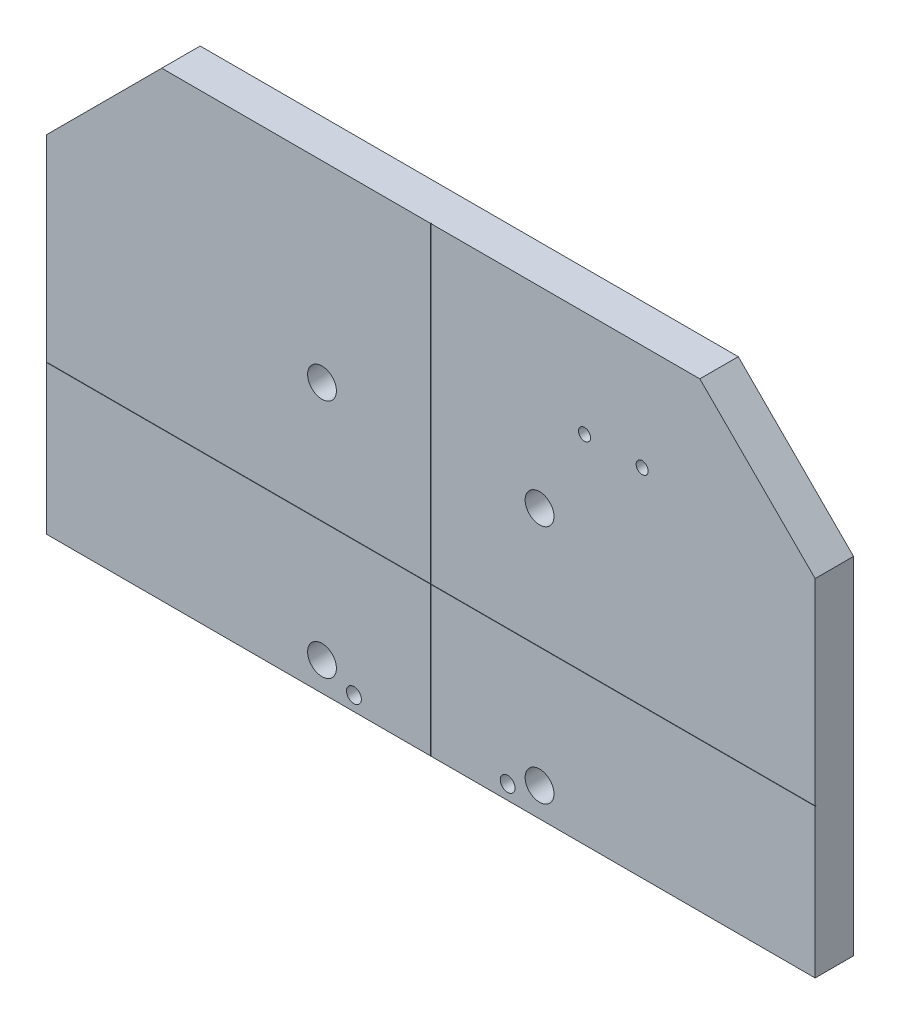
ISO-10303-21;
HEADER;
FILE_DESCRIPTION(('STEP AP214'),'2;1');
FILE_NAME('part.step','',(''),(''),'','','');
FILE_SCHEMA(('AUTOMOTIVE_DESIGN { 1 0 10303 214 1 1 1 1 }'));
ENDSEC;
DATA;
#1=APPLICATION_CONTEXT('core data for automotive mechanical design processes');
#2=APPLICATION_PROTOCOL_DEFINITION('international standard','automotive_design',2000,#1);
#3=PRODUCT_CONTEXT('',#1,'mechanical');
#4=PRODUCT('Part','Part','',(#3));
#5=PRODUCT_RELATED_PRODUCT_CATEGORY('part','',(#4));
#6=PRODUCT_DEFINITION_FORMATION('','',#4);
#7=PRODUCT_DEFINITION_CONTEXT('part definition',#1,'design');
#8=PRODUCT_DEFINITION('design','',#6,#7);
#9=PRODUCT_DEFINITION_SHAPE('','',#8);
#10=(LENGTH_UNIT() NAMED_UNIT(*) SI_UNIT(.MILLI.,.METRE.));
#11=(NAMED_UNIT(*) PLANE_ANGLE_UNIT() SI_UNIT($,.RADIAN.));
#12=(NAMED_UNIT(*) SI_UNIT($,.STERADIAN.) SOLID_ANGLE_UNIT());
#13=UNCERTAINTY_MEASURE_WITH_UNIT(LENGTH_MEASURE(1.E-05),#10,'distance_accuracy_value','');
#14=(GEOMETRIC_REPRESENTATION_CONTEXT(3) GLOBAL_UNCERTAINTY_ASSIGNED_CONTEXT((#13)) GLOBAL_UNIT_ASSIGNED_CONTEXT((#10,
#11,#12)) REPRESENTATION_CONTEXT('',''));
#15=CARTESIAN_POINT('',(0.,0.,0.));
#16=DIRECTION('',(0.,0.,1.));
#17=DIRECTION('',(1.,0.,0.));
#18=AXIS2_PLACEMENT_3D('',#15,#16,#17);
#19=CARTESIAN_POINT('',(0.,0.,25.4));
#20=DIRECTION('',(0.,0.,-1.));
#21=DIRECTION('',(-1.,0.,0.));
#22=AXIS2_PLACEMENT_3D('',#19,#20,#21);
#23=PLANE('',#22);
#24=CARTESIAN_POINT('',(44.6438421052629,-188.745394736842,25.4));
#25=DIRECTION('',(0.,0.,-1.));
#26=DIRECTION('',(-1.,0.,0.));
#27=AXIS2_PLACEMENT_3D('',#24,#25,#26);
#28=CIRCLE('',#27,9.525);
#29=CARTESIAN_POINT('',(35.1188421052629,-188.745394736842,25.4));
#30=VERTEX_POINT('',#29);
#31=EDGE_CURVE('E405',#30,#30,#28,.T.);
#32=ORIENTED_EDGE('',*,*,#31,.T.);
#33=EDGE_LOOP('',(#32));
#34=FACE_BOUND('',#33,.T.);
#35=CARTESIAN_POINT('',(23.561842105263,-198.270394736842,25.4));
#36=DIRECTION('',(0.,0.,-1.));
#37=DIRECTION('',(-1.,0.,0.));
#38=AXIS2_PLACEMENT_3D('',#35,#36,#37);
#39=CIRCLE('',#38,4.90219999999999);
#40=CARTESIAN_POINT('',(18.659642105263,-198.270394736842,25.4));
#41=VERTEX_POINT('',#40);
#42=EDGE_CURVE('E302',#41,#41,#39,.F.);
#43=ORIENTED_EDGE('',*,*,#42,.F.);
#44=EDGE_LOOP('',(#43));
#45=FACE_BOUND('',#44,.T.);
#46=DIRECTION('',(0.,1.,0.));
#47=VECTOR('',#46,1.);
#48=CARTESIAN_POINT('',(226.761842105263,-207.795394736842,25.4));
#49=LINE('',#48,#47);
#50=CARTESIAN_POINT('',(226.761842105263,-207.795394736842,25.4));
#51=VERTEX_POINT('',#50);
#52=CARTESIAN_POINT('',(226.761842105263,-109.497394736842,25.4));
#53=VERTEX_POINT('',#52);
#54=EDGE_CURVE('E159',#51,#53,#49,.T.);
#55=ORIENTED_EDGE('',*,*,#54,.T.);
#56=DIRECTION('',(1.,0.,0.));
#57=VECTOR('',#56,1.);
#58=CARTESIAN_POINT('',(-281.238157894737,-109.497394736842,25.4));
#59=LINE('',#58,#57);
#60=CARTESIAN_POINT('',(-27.1111578947371,-109.497394736842,25.4));
#61=VERTEX_POINT('',#60);
#62=EDGE_CURVE('E134',#61,#53,#59,.T.);
#63=ORIENTED_EDGE('',*,*,#62,.F.);
#64=DIRECTION('',(0.,1.,0.));
#65=VECTOR('',#64,1.);
#66=CARTESIAN_POINT('',(-27.1111578947371,-207.795394736842,25.4));
#67=LINE('',#66,#65);
#68=CARTESIAN_POINT('',(-27.1111578947371,-207.795394736842,25.4));
#69=VERTEX_POINT('',#68);
#70=EDGE_CURVE('E173',#69,#61,#67,.T.);
#71=ORIENTED_EDGE('',*,*,#70,.F.);
#72=DIRECTION('',(1.,0.,0.));
#73=VECTOR('',#72,1.);
#74=CARTESIAN_POINT('',(-281.238157894737,-207.795394736842,25.4));
#75=LINE('',#74,#73);
#76=EDGE_CURVE('E150',#69,#51,#75,.T.);
#77=ORIENTED_EDGE('',*,*,#76,.T.);
#78=EDGE_LOOP('',(#55,#63,#71,#77));
#79=FACE_BOUND('',#78,.T.);
#80=ADVANCED_FACE('F34',(#34,#45,#79),#23,.F.);
#81=CARTESIAN_POINT('',(-99.1201578947371,-188.745394736842,25.4));
#82=DIRECTION('',(0.,0.,-1.));
#83=DIRECTION('',(-1.,0.,0.));
#84=AXIS2_PLACEMENT_3D('',#81,#82,#83);
#85=CIRCLE('',#84,9.525);
#86=CARTESIAN_POINT('',(-108.645157894737,-188.745394736842,25.4));
#87=VERTEX_POINT('',#86);
#88=EDGE_CURVE('E296',#87,#87,#85,.T.);
#89=ORIENTED_EDGE('',*,*,#88,.T.);
#90=EDGE_LOOP('',(#89));
#91=FACE_BOUND('',#90,.T.);
#92=CARTESIAN_POINT('',(-78.0381578947371,-198.270394736842,25.4));
#93=DIRECTION('',(0.,0.,-1.));
#94=DIRECTION('',(-1.,0.,0.));
#95=AXIS2_PLACEMENT_3D('',#92,#93,#94);
#96=CIRCLE('',#95,4.9022);
#97=CARTESIAN_POINT('',(-82.940357894737,-198.270394736842,25.4));
#98=VERTEX_POINT('',#97);
#99=EDGE_CURVE('E314',#98,#98,#96,.F.);
#100=ORIENTED_EDGE('',*,*,#99,.F.);
#101=EDGE_LOOP('',(#100));
#102=FACE_BOUND('',#101,.T.);
#103=DIRECTION('',(0.,1.,0.));
#104=VECTOR('',#103,1.);
#105=CARTESIAN_POINT('',(-27.3651578947371,-207.795394736842,25.4));
#106=LINE('',#105,#104);
#107=CARTESIAN_POINT('',(-27.3651578947371,-207.795394736842,25.4));
#108=VERTEX_POINT('',#107);
#109=CARTESIAN_POINT('',(-27.3651578947371,-109.497394736842,25.4));
#110=VERTEX_POINT('',#109);
#111=EDGE_CURVE('E245',#108,#110,#106,.T.);
#112=ORIENTED_EDGE('',*,*,#111,.T.);
#113=CARTESIAN_POINT('',(-281.238157894737,-109.497394736842,25.4));
#114=VERTEX_POINT('',#113);
#115=EDGE_CURVE('E239',#114,#110,#59,.T.);
#116=ORIENTED_EDGE('',*,*,#115,.F.);
#117=DIRECTION('',(0.,-1.,0.));
#118=VECTOR('',#117,1.);
#119=CARTESIAN_POINT('',(-281.238157894737,20.8046052631579,25.4));
#120=LINE('',#119,#118);
#121=CARTESIAN_POINT('',(-281.238157894737,-207.795394736842,25.4));
#122=VERTEX_POINT('',#121);
#123=EDGE_CURVE('E143',#114,#122,#120,.T.);
#124=ORIENTED_EDGE('',*,*,#123,.T.);
#125=EDGE_CURVE('E152',#122,#108,#75,.T.);
#126=ORIENTED_EDGE('',*,*,#125,.T.);
#127=EDGE_LOOP('',(#112,#116,#124,#126));
#128=FACE_BOUND('',#127,.T.);
#129=ADVANCED_FACE('F334',(#91,#102,#128),#23,.F.);
#130=CARTESIAN_POINT('',(-27.1111578947371,-207.795394736842,25.4));
#131=CARTESIAN_POINT('',(-27.2381578947371,-207.795394736842,23.876));
#132=CARTESIAN_POINT('',(-27.3651578947371,-207.795394736842,25.4));
#133=B_SPLINE_CURVE_WITH_KNOTS('',2,(#130,#131,#132),.UNSPECIFIED.,.F.,.F.,(3,3),(0.,1.),.UNSPECIFIED.);
#134=DIRECTION('',(0.,1.,0.));
#135=VECTOR('',#134,1.);
#136=SURFACE_OF_LINEAR_EXTRUSION('',#133,#135);
#137=CARTESIAN_POINT('',(-27.3651578947371,-109.243394736842,25.4));
#138=VERTEX_POINT('',#137);
#139=CARTESIAN_POINT('',(-27.3651578947371,97.0046052631579,25.4));
#140=VERTEX_POINT('',#139);
#141=EDGE_CURVE('E59',#138,#140,#106,.T.);
#142=ORIENTED_EDGE('',*,*,#141,.F.);
#143=CARTESIAN_POINT('',(-27.3651578947371,-109.243394736842,25.4));
#144=CARTESIAN_POINT('',(-27.3623311640228,-109.246221467556,25.3661208062501));
#145=CARTESIAN_POINT('',(-27.3594179970927,-109.249134634487,25.3322553017689));
#146=CARTESIAN_POINT('',(-27.3533494764242,-109.255203155155,25.2644391079944));
#147=CARTESIAN_POINT('',(-27.350193257297,-109.258359374282,25.2304885740804));
#148=CARTESIAN_POINT('',(-27.3435839773658,-109.264968654213,25.1625857556148));
#149=CARTESIAN_POINT('',(-27.3401304204415,-109.268422211138,25.1286335664471));
#150=CARTESIAN_POINT('',(-27.3326585947945,-109.275894036785,25.0592175809432));
#151=CARTESIAN_POINT('',(-27.3286213985585,-109.279931233021,25.0237578444052));
#152=CARTESIAN_POINT('',(-27.3199341817907,-109.288618449789,24.9530267081136));
#153=CARTESIAN_POINT('',(-27.3152849030863,-109.293267728493,24.9177551333144));
#154=CARTESIAN_POINT('',(-27.3075359401627,-109.301016691416,24.8650949550325));
#155=CARTESIAN_POINT('',(-27.3048254878472,-109.303727143732,24.8475923521645));
#156=CARTESIAN_POINT('',(-27.2990393935693,-109.30951323801,24.812709323625));
#157=CARTESIAN_POINT('',(-27.295963843825,-109.312588787754,24.7953288682707));
#158=CARTESIAN_POINT('',(-27.2901387232055,-109.318413908374,24.7653705910582));
#159=CARTESIAN_POINT('',(-27.2875192502964,-109.321033381283,24.752742311698));
#160=CARTESIAN_POINT('',(-27.2818318634975,-109.326720768082,24.7277200470654));
#161=CARTESIAN_POINT('',(-27.2787653275465,-109.329787304033,24.7153254694827));
#162=CARTESIAN_POINT('',(-27.2739650593901,-109.334587572189,24.698494182416));
#163=CARTESIAN_POINT('',(-27.2725755638676,-109.335977067712,24.6938634939294));
#164=CARTESIAN_POINT('',(-27.2696327888575,-109.338919842722,24.684699414834));
#165=CARTESIAN_POINT('',(-27.2680792846255,-109.340473346954,24.680166168257));
#166=CARTESIAN_POINT('',(-27.2647181077493,-109.34383452383,24.6711921906048));
#167=CARTESIAN_POINT('',(-27.2629068523104,-109.345645779269,24.66675400124));
#168=CARTESIAN_POINT('',(-27.2589372930596,-109.34961533852,24.6582105165422));
#169=CARTESIAN_POINT('',(-27.2567791829199,-109.351773448659,24.654105037348));
#170=CARTESIAN_POINT('',(-27.251831785716,-109.356720845863,24.6465322025202));
#171=CARTESIAN_POINT('',(-27.2490398058636,-109.359512825716,24.6430676872145));
#172=CARTESIAN_POINT('',(-27.2440781112852,-109.364474520294,24.6395319813065));
#173=CARTESIAN_POINT('',(-27.2422447869758,-109.366307844604,24.6386305444928));
#174=CARTESIAN_POINT('',(-27.2396336011086,-109.368919030471,24.6380743633754));
#175=CARTESIAN_POINT('',(-27.2388971149605,-109.369655516619,24.6379941919963));
#176=CARTESIAN_POINT('',(-27.2381578947371,-109.370394736842,24.638));
#177=B_SPLINE_CURVE_WITH_KNOTS('',3,(#143,#144,#145,#146,#147,#148,#149,#150,#151,#152,#153,
#154,#155,#156,#157,#158,#159,#160,#161,#162,#163,#164,#165,#166,#167,#168,#169,#170,#171,#172,
#173,#174,#175,#176),.UNSPECIFIED.,.F.,.F.,(4,2,2,2,2,2,2,2,2,2,2,2,2,2,2,2,4),(0.,
0.102343514307504,0.205069959695053,0.307971259356194,0.415715340605922,0.523330020869911,
0.577078060717716,0.630812553394177,0.670286743818626,0.709641742894189,0.724727876500865,
0.739834958058471,0.755177403743357,0.770511312277877,0.785911622999607,0.793981438851478,
0.797108063588324),.UNSPECIFIED.);
#178=CARTESIAN_POINT('',(-27.2381578947371,-109.370394736842,24.638));
#179=VERTEX_POINT('',#178);
#180=EDGE_CURVE('E11',#138,#179,#177,.T.);
#181=ORIENTED_EDGE('',*,*,#180,.T.);
#182=CARTESIAN_POINT('',(-27.1111578947371,-109.243394736842,25.4));
#183=CARTESIAN_POINT('',(-27.1147586622942,-109.246995504399,25.356924352958));
#184=CARTESIAN_POINT('',(-27.1184894258524,-109.250726267957,25.3138675667452));
#185=CARTESIAN_POINT('',(-27.1263514287,-109.258588270805,25.2278169636741));
#186=CARTESIAN_POINT('',(-27.1304827652935,-109.262719607399,25.1848231647039));
#187=CARTESIAN_POINT('',(-27.1378363759387,-109.270073218044,25.1130764024399));
#188=CARTESIAN_POINT('',(-27.1409103571466,-109.273147199252,25.0842934057058));
#189=CARTESIAN_POINT('',(-27.1473831154631,-109.279619957568,25.0268024596024));
#190=CARTESIAN_POINT('',(-27.1507818733682,-109.283018715473,24.9980945058989));
#191=CARTESIAN_POINT('',(-27.1592630339229,-109.291499876028,24.930915655898));
#192=CARTESIAN_POINT('',(-27.164522156498,-109.296758998603,24.8924874311045));
#193=CARTESIAN_POINT('',(-27.1745268675176,-109.306763709623,24.8285156796447));
#194=CARTESIAN_POINT('',(-27.1788813795354,-109.31111822164,24.8028539448921));
#195=CARTESIAN_POINT('',(-27.1871894401185,-109.319426282223,24.7601905899864));
#196=CARTESIAN_POINT('',(-27.1908186518875,-109.323055493992,24.7430675264785));
#197=CARTESIAN_POINT('',(-27.1977748935544,-109.330011735659,24.7146682490488));
#198=CARTESIAN_POINT('',(-27.2008309585286,-109.333067800634,24.703264436336));
#199=CARTESIAN_POINT('',(-27.2067151101411,-109.338951952246,24.6844268998598));
#200=CARTESIAN_POINT('',(-27.2093195041672,-109.341556346272,24.6768596170707));
#201=CARTESIAN_POINT('',(-27.2138733898308,-109.346110231936,24.6657506417784));
#202=CARTESIAN_POINT('',(-27.215550180326,-109.347787022431,24.6619975045873));
#203=CARTESIAN_POINT('',(-27.2192041243174,-109.351440966422,24.6548061916142));
#204=CARTESIAN_POINT('',(-27.2211817483506,-109.353418590456,24.6513685230057));
#205=CARTESIAN_POINT('',(-27.2259267056595,-109.358163547765,24.6447820481746));
#206=CARTESIAN_POINT('',(-27.228753286126,-109.360990128231,24.6416966350844));
#207=CARTESIAN_POINT('',(-27.2338707468323,-109.366107588937,24.638693580646));
#208=CARTESIAN_POINT('',(-27.2359496698804,-109.368186511985,24.6380140542789));
#209=CARTESIAN_POINT('',(-27.2381578947371,-109.370394736842,24.638));
#210=B_SPLINE_CURVE_WITH_KNOTS('',3,(#182,#183,#184,#185,#186,#187,#188,#189,#190,#191,#192,
#193,#194,#195,#196,#197,#198,#199,#200,#201,#202,#203,#204,#205,#206,#207,#208,#209),
.UNSPECIFIED.,.F.,.F.,(4,2,2,2,2,2,2,2,2,2,2,2,2,4),(0.,0.130130838363292,0.260293366673186,
0.347618440608603,0.434938354340637,0.552330718668359,0.631470489546054,0.685063011786181,
0.721611553206466,0.746815189795231,0.760100411875049,0.773406631325164,0.788045246346206,
0.797054853059102),.UNSPECIFIED.);
#211=CARTESIAN_POINT('',(-27.1111578947371,-109.243394736842,25.4));
#212=VERTEX_POINT('',#211);
#213=EDGE_CURVE('E199',#179,#212,#210,.F.);
#214=ORIENTED_EDGE('',*,*,#213,.T.);
#215=CARTESIAN_POINT('',(-27.1111578947372,97.0046052631579,25.4));
#216=VERTEX_POINT('',#215);
#217=EDGE_CURVE('E244',#212,#216,#67,.T.);
#218=ORIENTED_EDGE('',*,*,#217,.T.);
#219=CARTESIAN_POINT('',(-27.1111578947372,97.0046052631579,25.4));
#220=CARTESIAN_POINT('',(-27.2381578947372,97.0046052631579,23.876));
#221=CARTESIAN_POINT('',(-27.3651578947372,97.0046052631579,25.4));
#222=B_SPLINE_CURVE_WITH_KNOTS('',2,(#219,#220,#221),.UNSPECIFIED.,.F.,.F.,(3,3),(0.,1.),.UNSPECIFIED.);
#223=EDGE_CURVE('E231',#216,#140,#222,.T.);
#224=ORIENTED_EDGE('',*,*,#223,.T.);
#225=EDGE_LOOP('',(#142,#181,#214,#218,#224));
#226=FACE_BOUND('',#225,.T.);
#227=ADVANCED_FACE('F221',(#226),#136,.F.);
#228=CARTESIAN_POINT('',(44.6438421052629,-29.9953947368421,25.4));
#229=DIRECTION('',(0.,0.,-1.));
#230=DIRECTION('',(-1.,0.,0.));
#231=AXIS2_PLACEMENT_3D('',#228,#229,#230);
#232=CIRCLE('',#231,9.525);
#233=CARTESIAN_POINT('',(35.1188421052629,-29.9953947368421,25.4));
#234=VERTEX_POINT('',#233);
#235=EDGE_CURVE('E361',#234,#234,#232,.T.);
#236=ORIENTED_EDGE('',*,*,#235,.T.);
#237=EDGE_LOOP('',(#236));
#238=FACE_BOUND('',#237,.T.);
#239=CARTESIAN_POINT('',(112.461842105263,27.1546052631579,25.4));
#240=DIRECTION('',(0.,0.,-1.));
#241=DIRECTION('',(-1.,0.,0.));
#242=AXIS2_PLACEMENT_3D('',#239,#240,#241);
#243=CIRCLE('',#242,3.97509999999999);
#244=CARTESIAN_POINT('',(108.486742105263,27.1546052631579,25.4));
#245=VERTEX_POINT('',#244);
#246=EDGE_CURVE('E299',#245,#245,#243,.F.);
#247=ORIENTED_EDGE('',*,*,#246,.F.);
#248=EDGE_LOOP('',(#247));
#249=FACE_BOUND('',#248,.T.);
#250=CARTESIAN_POINT('',(74.3618421052629,27.1546052631579,25.4));
#251=DIRECTION('',(0.,0.,-1.));
#252=DIRECTION('',(-1.,0.,0.));
#253=AXIS2_PLACEMENT_3D('',#250,#251,#252);
#254=CIRCLE('',#253,3.97510000000001);
#255=CARTESIAN_POINT('',(70.3867421052629,27.1546052631579,25.4));
#256=VERTEX_POINT('',#255);
#257=EDGE_CURVE('E295',#256,#256,#254,.F.);
#258=ORIENTED_EDGE('',*,*,#257,.F.);
#259=EDGE_LOOP('',(#258));
#260=FACE_BOUND('',#259,.T.);
#261=ORIENTED_EDGE('',*,*,#217,.F.);
#262=DIRECTION('',(1.,0.,0.));
#263=VECTOR('',#262,1.);
#264=CARTESIAN_POINT('',(-281.238157894737,-109.243394736842,25.4));
#265=LINE('',#264,#263);
#266=CARTESIAN_POINT('',(226.761842105263,-109.243394736842,25.4));
#267=VERTEX_POINT('',#266);
#268=EDGE_CURVE('E51',#212,#267,#265,.T.);
#269=ORIENTED_EDGE('',*,*,#268,.T.);
#270=CARTESIAN_POINT('',(226.761842105263,20.8046052631578,25.4));
#271=VERTEX_POINT('',#270);
#272=EDGE_CURVE('E158',#267,#271,#49,.T.);
#273=ORIENTED_EDGE('',*,*,#272,.T.);
#274=DIRECTION('',(-0.707106781186548,0.707106781186547,0.));
#275=VECTOR('',#274,1.);
#276=CARTESIAN_POINT('',(226.761842105263,20.8046052631578,25.4));
#277=LINE('',#276,#275);
#278=CARTESIAN_POINT('',(150.561842105263,97.0046052631579,25.4));
#279=VERTEX_POINT('',#278);
#280=EDGE_CURVE('E162',#271,#279,#277,.T.);
#281=ORIENTED_EDGE('',*,*,#280,.T.);
#282=DIRECTION('',(-1.,0.,0.));
#283=VECTOR('',#282,1.);
#284=CARTESIAN_POINT('',(150.561842105263,97.0046052631579,25.4));
#285=LINE('',#284,#283);
#286=EDGE_CURVE('E165',#279,#216,#285,.T.);
#287=ORIENTED_EDGE('',*,*,#286,.T.);
#288=EDGE_LOOP('',(#261,#269,#273,#281,#287));
#289=FACE_BOUND('',#288,.T.);
#290=ADVANCED_FACE('F257',(#238,#249,#260,#289),#23,.F.);
#291=CARTESIAN_POINT('',(-205.038157894737,97.0046052631579,25.4));
#292=DIRECTION('',(0.707106781186548,-0.707106781186547,0.));
#293=DIRECTION('',(0.707106781186547,0.707106781186548,0.));
#294=AXIS2_PLACEMENT_3D('',#291,#292,#293);
#295=PLANE('',#294);
#296=DIRECTION('',(-0.707106781186547,-0.707106781186548,0.));
#297=VECTOR('',#296,1.);
#298=CARTESIAN_POINT('',(-205.038157894737,97.0046052631579,0.));
#299=LINE('',#298,#297);
#300=CARTESIAN_POINT('',(-205.038157894737,97.0046052631579,0.));
#301=VERTEX_POINT('',#300);
#302=CARTESIAN_POINT('',(-281.238157894737,20.8046052631579,0.));
#303=VERTEX_POINT('',#302);
#304=EDGE_CURVE('E169',#301,#303,#299,.T.);
#305=ORIENTED_EDGE('',*,*,#304,.T.);
#306=DIRECTION('',(0.,0.,-1.));
#307=VECTOR('',#306,1.);
#308=CARTESIAN_POINT('',(-281.238157894737,20.8046052631579,25.4));
#309=LINE('',#308,#307);
#310=CARTESIAN_POINT('',(-281.238157894737,20.8046052631579,25.4));
#311=VERTEX_POINT('',#310);
#312=EDGE_CURVE('E197',#311,#303,#309,.T.);
#313=ORIENTED_EDGE('',*,*,#312,.F.);
#314=DIRECTION('',(-0.707106781186547,-0.707106781186548,0.));
#315=VECTOR('',#314,1.);
#316=CARTESIAN_POINT('',(-205.038157894737,97.0046052631579,25.4));
#317=LINE('',#316,#315);
#318=CARTESIAN_POINT('',(-205.038157894737,97.0046052631579,25.4));
#319=VERTEX_POINT('',#318);
#320=EDGE_CURVE('E148',#319,#311,#317,.T.);
#321=ORIENTED_EDGE('',*,*,#320,.F.);
#322=DIRECTION('',(0.,0.,-1.));
#323=VECTOR('',#322,1.);
#324=CARTESIAN_POINT('',(-205.038157894737,97.0046052631579,25.4));
#325=LINE('',#324,#323);
#326=EDGE_CURVE('E168',#319,#301,#325,.T.);
#327=ORIENTED_EDGE('',*,*,#326,.T.);
#328=EDGE_LOOP('',(#305,#313,#321,#327));
#329=FACE_BOUND('',#328,.T.);
#330=ADVANCED_FACE('F36',(#329),#295,.F.);
#331=CARTESIAN_POINT('',(-281.238157894737,20.8046052631579,25.4));
#332=DIRECTION('',(1.,0.,0.));
#333=DIRECTION('',(0.,1.,0.));
#334=AXIS2_PLACEMENT_3D('',#331,#332,#333);
#335=PLANE('',#334);
#336=ORIENTED_EDGE('',*,*,#123,.F.);
#337=CARTESIAN_POINT('',(-281.238157894737,-109.497394736842,25.4));
#338=CARTESIAN_POINT('',(-281.238157894737,-109.370394736842,23.876));
#339=CARTESIAN_POINT('',(-281.238157894737,-109.243394736842,25.4));
#340=B_SPLINE_CURVE_WITH_KNOTS('',2,(#337,#338,#339),.UNSPECIFIED.,.F.,.F.,(3,3),(0.,1.),.UNSPECIFIED.);
#341=CARTESIAN_POINT('',(-281.238157894737,-109.243394736842,25.4));
#342=VERTEX_POINT('',#341);
#343=EDGE_CURVE('E131',#114,#342,#340,.T.);
#344=ORIENTED_EDGE('',*,*,#343,.T.);
#345=EDGE_CURVE('E140',#311,#342,#120,.T.);
#346=ORIENTED_EDGE('',*,*,#345,.F.);
#347=ORIENTED_EDGE('',*,*,#312,.T.);
#348=DIRECTION('',(0.,-1.,0.));
#349=VECTOR('',#348,1.);
#350=CARTESIAN_POINT('',(-281.238157894737,20.8046052631579,0.));
#351=LINE('',#350,#349);
#352=CARTESIAN_POINT('',(-281.238157894737,-207.795394736842,0.));
#353=VERTEX_POINT('',#352);
#354=EDGE_CURVE('E172',#303,#353,#351,.T.);
#355=ORIENTED_EDGE('',*,*,#354,.T.);
#356=DIRECTION('',(0.,0.,-1.));
#357=VECTOR('',#356,1.);
#358=CARTESIAN_POINT('',(-281.238157894737,-207.795394736842,25.4));
#359=LINE('',#358,#357);
#360=EDGE_CURVE('E194',#122,#353,#359,.T.);
#361=ORIENTED_EDGE('',*,*,#360,.F.);
#362=EDGE_LOOP('',(#336,#344,#346,#347,#355,#361));
#363=FACE_BOUND('',#362,.T.);
#364=ADVANCED_FACE('F138',(#363),#335,.F.);
#365=CARTESIAN_POINT('',(-281.238157894737,-207.795394736842,25.4));
#366=DIRECTION('',(0.,1.,0.));
#367=DIRECTION('',(0.,0.,1.));
#368=AXIS2_PLACEMENT_3D('',#365,#366,#367);
#369=PLANE('',#368);
#370=ORIENTED_EDGE('',*,*,#76,.F.);
#371=EDGE_CURVE('E225',#69,#108,#133,.T.);
#372=ORIENTED_EDGE('',*,*,#371,.T.);
#373=ORIENTED_EDGE('',*,*,#125,.F.);
#374=ORIENTED_EDGE('',*,*,#360,.T.);
#375=DIRECTION('',(1.,0.,0.));
#376=VECTOR('',#375,1.);
#377=CARTESIAN_POINT('',(-281.238157894737,-207.795394736842,0.));
#378=LINE('',#377,#376);
#379=CARTESIAN_POINT('',(226.761842105263,-207.795394736842,0.));
#380=VERTEX_POINT('',#379);
#381=EDGE_CURVE('E175',#353,#380,#378,.T.);
#382=ORIENTED_EDGE('',*,*,#381,.T.);
#383=DIRECTION('',(0.,0.,-1.));
#384=VECTOR('',#383,1.);
#385=CARTESIAN_POINT('',(226.761842105263,-207.795394736842,25.4));
#386=LINE('',#385,#384);
#387=EDGE_CURVE('E191',#51,#380,#386,.T.);
#388=ORIENTED_EDGE('',*,*,#387,.F.);
#389=EDGE_LOOP('',(#370,#372,#373,#374,#382,#388));
#390=FACE_BOUND('',#389,.T.);
#391=ADVANCED_FACE('F274',(#390),#369,.F.);
#392=CARTESIAN_POINT('',(226.761842105263,-207.795394736842,25.4));
#393=DIRECTION('',(-1.,0.,0.));
#394=DIRECTION('',(0.,0.,1.));
#395=AXIS2_PLACEMENT_3D('',#392,#393,#394);
#396=PLANE('',#395);
#397=ORIENTED_EDGE('',*,*,#272,.F.);
#398=CARTESIAN_POINT('',(226.761842105263,-109.497394736842,25.4));
#399=CARTESIAN_POINT('',(226.761842105263,-109.370394736842,23.876));
#400=CARTESIAN_POINT('',(226.761842105263,-109.243394736842,25.4));
#401=B_SPLINE_CURVE_WITH_KNOTS('',2,(#398,#399,#400),.UNSPECIFIED.,.F.,.F.,(3,3),(0.,1.),.UNSPECIFIED.);
#402=EDGE_CURVE('E144',#53,#267,#401,.T.);
#403=ORIENTED_EDGE('',*,*,#402,.F.);
#404=ORIENTED_EDGE('',*,*,#54,.F.);
#405=ORIENTED_EDGE('',*,*,#387,.T.);
#406=DIRECTION('',(0.,1.,0.));
#407=VECTOR('',#406,1.);
#408=CARTESIAN_POINT('',(226.761842105263,-207.795394736842,0.));
#409=LINE('',#408,#407);
#410=CARTESIAN_POINT('',(226.761842105263,20.8046052631578,0.));
#411=VERTEX_POINT('',#410);
#412=EDGE_CURVE('E177',#380,#411,#409,.T.);
#413=ORIENTED_EDGE('',*,*,#412,.T.);
#414=DIRECTION('',(0.,0.,-1.));
#415=VECTOR('',#414,1.);
#416=CARTESIAN_POINT('',(226.761842105263,20.8046052631578,25.4));
#417=LINE('',#416,#415);
#418=EDGE_CURVE('E188',#271,#411,#417,.T.);
#419=ORIENTED_EDGE('',*,*,#418,.F.);
#420=EDGE_LOOP('',(#397,#403,#404,#405,#413,#419));
#421=FACE_BOUND('',#420,.T.);
#422=ADVANCED_FACE('F277',(#421),#396,.F.);
#423=CARTESIAN_POINT('',(226.761842105263,20.8046052631578,25.4));
#424=DIRECTION('',(-0.707106781186547,-0.707106781186548,0.));
#425=DIRECTION('',(0.707106781186548,-0.707106781186547,0.));
#426=AXIS2_PLACEMENT_3D('',#423,#424,#425);
#427=PLANE('',#426);
#428=DIRECTION('',(-0.707106781186548,0.707106781186547,0.));
#429=VECTOR('',#428,1.);
#430=CARTESIAN_POINT('',(226.761842105263,20.8046052631578,0.));
#431=LINE('',#430,#429);
#432=CARTESIAN_POINT('',(150.561842105263,97.0046052631579,0.));
#433=VERTEX_POINT('',#432);
#434=EDGE_CURVE('E179',#411,#433,#431,.T.);
#435=ORIENTED_EDGE('',*,*,#434,.T.);
#436=DIRECTION('',(0.,0.,-1.));
#437=VECTOR('',#436,1.);
#438=CARTESIAN_POINT('',(150.561842105263,97.0046052631579,25.4));
#439=LINE('',#438,#437);
#440=EDGE_CURVE('E185',#279,#433,#439,.T.);
#441=ORIENTED_EDGE('',*,*,#440,.F.);
#442=ORIENTED_EDGE('',*,*,#280,.F.);
#443=ORIENTED_EDGE('',*,*,#418,.T.);
#444=EDGE_LOOP('',(#435,#441,#442,#443));
#445=FACE_BOUND('',#444,.T.);
#446=ADVANCED_FACE('F263',(#445),#427,.F.);
#447=CARTESIAN_POINT('',(150.561842105263,97.0046052631579,25.4));
#448=DIRECTION('',(0.,-1.,0.));
#449=DIRECTION('',(1.,0.,0.));
#450=AXIS2_PLACEMENT_3D('',#447,#448,#449);
#451=PLANE('',#450);
#452=EDGE_CURVE('E164',#140,#319,#285,.T.);
#453=ORIENTED_EDGE('',*,*,#452,.F.);
#454=ORIENTED_EDGE('',*,*,#223,.F.);
#455=ORIENTED_EDGE('',*,*,#286,.F.);
#456=ORIENTED_EDGE('',*,*,#440,.T.);
#457=DIRECTION('',(-1.,0.,0.));
#458=VECTOR('',#457,1.);
#459=CARTESIAN_POINT('',(150.561842105263,97.0046052631579,0.));
#460=LINE('',#459,#458);
#461=EDGE_CURVE('E181',#433,#301,#460,.T.);
#462=ORIENTED_EDGE('',*,*,#461,.T.);
#463=ORIENTED_EDGE('',*,*,#326,.F.);
#464=EDGE_LOOP('',(#453,#454,#455,#456,#462,#463));
#465=FACE_BOUND('',#464,.T.);
#466=ADVANCED_FACE('F255',(#465),#451,.F.);
#467=CARTESIAN_POINT('',(-99.1201578947371,-29.9953947368421,25.4));
#468=DIRECTION('',(0.,0.,-1.));
#469=DIRECTION('',(-1.,0.,0.));
#470=AXIS2_PLACEMENT_3D('',#467,#468,#469);
#471=CIRCLE('',#470,9.52500000000001);
#472=CARTESIAN_POINT('',(-108.645157894737,-29.9953947368421,25.4));
#473=VERTEX_POINT('',#472);
#474=EDGE_CURVE('E406',#473,#473,#471,.T.);
#475=ORIENTED_EDGE('',*,*,#474,.T.);
#476=EDGE_LOOP('',(#475));
#477=FACE_BOUND('',#476,.T.);
#478=ORIENTED_EDGE('',*,*,#345,.T.);
#479=EDGE_CURVE('E128',#342,#138,#265,.T.);
#480=ORIENTED_EDGE('',*,*,#479,.T.);
#481=ORIENTED_EDGE('',*,*,#141,.T.);
#482=ORIENTED_EDGE('',*,*,#452,.T.);
#483=ORIENTED_EDGE('',*,*,#320,.T.);
#484=EDGE_LOOP('',(#478,#480,#481,#482,#483));
#485=FACE_BOUND('',#484,.T.);
#486=ADVANCED_FACE('F146',(#477,#485),#23,.F.);
#487=CARTESIAN_POINT('',(0.,0.,0.));
#488=DIRECTION('',(0.,0.,-1.));
#489=DIRECTION('',(-1.,0.,0.));
#490=AXIS2_PLACEMENT_3D('',#487,#488,#489);
#491=PLANE('',#490);
#492=CARTESIAN_POINT('',(-99.1201578947371,-188.745394736842,0.));
#493=DIRECTION('',(0.,0.,-1.));
#494=DIRECTION('',(-1.,0.,0.));
#495=AXIS2_PLACEMENT_3D('',#492,#493,#494);
#496=CIRCLE('',#495,9.525);
#497=CARTESIAN_POINT('',(-108.645157894737,-188.745394736842,0.));
#498=VERTEX_POINT('',#497);
#499=EDGE_CURVE('E420',#498,#498,#496,.T.);
#500=ORIENTED_EDGE('',*,*,#499,.F.);
#501=EDGE_LOOP('',(#500));
#502=FACE_BOUND('',#501,.T.);
#503=CARTESIAN_POINT('',(44.6438421052629,-188.745394736842,0.));
#504=DIRECTION('',(0.,0.,-1.));
#505=DIRECTION('',(-1.,0.,0.));
#506=AXIS2_PLACEMENT_3D('',#503,#504,#505);
#507=CIRCLE('',#506,9.525);
#508=CARTESIAN_POINT('',(35.1188421052629,-188.745394736842,0.));
#509=VERTEX_POINT('',#508);
#510=EDGE_CURVE('E423',#509,#509,#507,.T.);
#511=ORIENTED_EDGE('',*,*,#510,.F.);
#512=EDGE_LOOP('',(#511));
#513=FACE_BOUND('',#512,.T.);
#514=CARTESIAN_POINT('',(44.6438421052629,-29.9953947368421,0.));
#515=DIRECTION('',(0.,0.,-1.));
#516=DIRECTION('',(-1.,0.,0.));
#517=AXIS2_PLACEMENT_3D('',#514,#515,#516);
#518=CIRCLE('',#517,9.525);
#519=CARTESIAN_POINT('',(35.1188421052629,-29.9953947368421,0.));
#520=VERTEX_POINT('',#519);
#521=EDGE_CURVE('E404',#520,#520,#518,.T.);
#522=ORIENTED_EDGE('',*,*,#521,.F.);
#523=EDGE_LOOP('',(#522));
#524=FACE_BOUND('',#523,.T.);
#525=CARTESIAN_POINT('',(-99.1201578947371,-29.9953947368421,0.));
#526=DIRECTION('',(0.,0.,-1.));
#527=DIRECTION('',(-1.,0.,0.));
#528=AXIS2_PLACEMENT_3D('',#525,#526,#527);
#529=CIRCLE('',#528,9.52500000000001);
#530=CARTESIAN_POINT('',(-108.645157894737,-29.9953947368421,0.));
#531=VERTEX_POINT('',#530);
#532=EDGE_CURVE('E409',#531,#531,#529,.T.);
#533=ORIENTED_EDGE('',*,*,#532,.F.);
#534=EDGE_LOOP('',(#533));
#535=FACE_BOUND('',#534,.T.);
#536=CARTESIAN_POINT('',(-78.0381578947371,-198.270394736842,0.));
#537=DIRECTION('',(0.,0.,-1.));
#538=DIRECTION('',(-1.,0.,0.));
#539=AXIS2_PLACEMENT_3D('',#536,#537,#538);
#540=CIRCLE('',#539,4.9022);
#541=CARTESIAN_POINT('',(-82.940357894737,-198.270394736842,0.));
#542=VERTEX_POINT('',#541);
#543=EDGE_CURVE('E38',#542,#542,#540,.F.);
#544=ORIENTED_EDGE('',*,*,#543,.T.);
#545=EDGE_LOOP('',(#544));
#546=FACE_BOUND('',#545,.T.);
#547=CARTESIAN_POINT('',(23.561842105263,-198.270394736842,0.));
#548=DIRECTION('',(0.,0.,-1.));
#549=DIRECTION('',(-1.,0.,0.));
#550=AXIS2_PLACEMENT_3D('',#547,#548,#549);
#551=CIRCLE('',#550,4.90219999999999);
#552=CARTESIAN_POINT('',(18.659642105263,-198.270394736842,0.));
#553=VERTEX_POINT('',#552);
#554=EDGE_CURVE('E300',#553,#553,#551,.F.);
#555=ORIENTED_EDGE('',*,*,#554,.T.);
#556=EDGE_LOOP('',(#555));
#557=FACE_BOUND('',#556,.T.);
#558=CARTESIAN_POINT('',(112.461842105263,27.1546052631579,0.));
#559=DIRECTION('',(0.,0.,-1.));
#560=DIRECTION('',(-1.,0.,0.));
#561=AXIS2_PLACEMENT_3D('',#558,#559,#560);
#562=CIRCLE('',#561,3.97509999999999);
#563=CARTESIAN_POINT('',(108.486742105263,27.1546052631579,0.));
#564=VERTEX_POINT('',#563);
#565=EDGE_CURVE('E297',#564,#564,#562,.F.);
#566=ORIENTED_EDGE('',*,*,#565,.T.);
#567=EDGE_LOOP('',(#566));
#568=FACE_BOUND('',#567,.T.);
#569=CARTESIAN_POINT('',(74.3618421052629,27.1546052631579,0.));
#570=DIRECTION('',(0.,0.,-1.));
#571=DIRECTION('',(-1.,0.,0.));
#572=AXIS2_PLACEMENT_3D('',#569,#570,#571);
#573=CIRCLE('',#572,3.97510000000001);
#574=CARTESIAN_POINT('',(70.3867421052629,27.1546052631579,0.));
#575=VERTEX_POINT('',#574);
#576=EDGE_CURVE('E292',#575,#575,#573,.F.);
#577=ORIENTED_EDGE('',*,*,#576,.T.);
#578=EDGE_LOOP('',(#577));
#579=FACE_BOUND('',#578,.T.);
#580=ORIENTED_EDGE('',*,*,#304,.F.);
#581=ORIENTED_EDGE('',*,*,#461,.F.);
#582=ORIENTED_EDGE('',*,*,#434,.F.);
#583=ORIENTED_EDGE('',*,*,#412,.F.);
#584=ORIENTED_EDGE('',*,*,#381,.F.);
#585=ORIENTED_EDGE('',*,*,#354,.F.);
#586=EDGE_LOOP('',(#580,#581,#582,#583,#584,#585));
#587=FACE_BOUND('',#586,.T.);
#588=ADVANCED_FACE('F219',(#502,#513,#524,#535,#546,#557,#568,#579,#587),#491,.T.);
#589=ORIENTED_EDGE('',*,*,#70,.T.);
#590=CARTESIAN_POINT('',(-27.1111578947371,-109.497394736842,25.4));
#591=CARTESIAN_POINT('',(-27.1147586622942,-109.493793969285,25.356924352958));
#592=CARTESIAN_POINT('',(-27.1184894258524,-109.490063205727,25.3138675667452));
#593=CARTESIAN_POINT('',(-27.1263514287,-109.482201202879,25.2278169636741));
#594=CARTESIAN_POINT('',(-27.1304827652936,-109.478069866286,25.1848231647038));
#595=CARTESIAN_POINT('',(-27.1378363759387,-109.470716255641,25.1130764024398));
#596=CARTESIAN_POINT('',(-27.1409103571466,-109.467642274433,25.0842934057058));
#597=CARTESIAN_POINT('',(-27.1473831154631,-109.461169516116,25.0268024596024));
#598=CARTESIAN_POINT('',(-27.1507818733682,-109.457770758211,24.9980945058988));
#599=CARTESIAN_POINT('',(-27.1592630339229,-109.449289597656,24.9309156558979));
#600=CARTESIAN_POINT('',(-27.164522156498,-109.444030475081,24.8924874311045));
#601=CARTESIAN_POINT('',(-27.1745268675176,-109.434025764062,24.8285156796447));
#602=CARTESIAN_POINT('',(-27.1788813795354,-109.429671252044,24.802853944892));
#603=CARTESIAN_POINT('',(-27.1871894401185,-109.421363191461,24.7601905899864));
#604=CARTESIAN_POINT('',(-27.1908186518875,-109.417733979692,24.7430675264785));
#605=CARTESIAN_POINT('',(-27.1977748935544,-109.410777738025,24.7146682490488));
#606=CARTESIAN_POINT('',(-27.2008309585286,-109.407721673051,24.703264436336));
#607=CARTESIAN_POINT('',(-27.2067151101411,-109.401837521438,24.6844268998597));
#608=CARTESIAN_POINT('',(-27.2093195041672,-109.399233127412,24.6768596170707));
#609=CARTESIAN_POINT('',(-27.2138733898309,-109.394679241748,24.6657506417783));
#610=CARTESIAN_POINT('',(-27.215550180326,-109.393002451253,24.6619975045873));
#611=CARTESIAN_POINT('',(-27.2192041243175,-109.389348507262,24.6548061916141));
#612=CARTESIAN_POINT('',(-27.2211817483507,-109.387370883229,24.6513685230057));
#613=CARTESIAN_POINT('',(-27.2259267056595,-109.38262592592,24.6447820481746));
#614=CARTESIAN_POINT('',(-27.228753286126,-109.379799345453,24.6416966350844));
#615=CARTESIAN_POINT('',(-27.2338707468324,-109.374681884747,24.638693580646));
#616=CARTESIAN_POINT('',(-27.2359496698804,-109.372602961699,24.6380140542789));
#617=CARTESIAN_POINT('',(-27.2381578947371,-109.370394736842,24.638));
#618=B_SPLINE_CURVE_WITH_KNOTS('',3,(#590,#591,#592,#593,#594,#595,#596,#597,#598,#599,#600,
#601,#602,#603,#604,#605,#606,#607,#608,#609,#610,#611,#612,#613,#614,#615,#616,#617),
.UNSPECIFIED.,.F.,.F.,(4,2,2,2,2,2,2,2,2,2,2,2,2,4),(0.,0.130130838363324,0.260293366673257,
0.347618440608683,0.434938354340726,0.552330718668428,0.631470489546092,0.685063011786229,
0.721611553206512,0.746815189795282,0.760100411875096,0.773406631325219,0.788045246346203,
0.797054853059087),.UNSPECIFIED.);
#619=EDGE_CURVE('E43',#61,#179,#618,.T.);
#620=ORIENTED_EDGE('',*,*,#619,.T.);
#621=CARTESIAN_POINT('',(-27.3651578947371,-109.497394736842,25.4));
#622=CARTESIAN_POINT('',(-27.36155712718,-109.493793969285,25.356924352958));
#623=CARTESIAN_POINT('',(-27.3578263636218,-109.490063205727,25.3138675667451));
#624=CARTESIAN_POINT('',(-27.3499643607743,-109.482201202879,25.227816963674));
#625=CARTESIAN_POINT('',(-27.3458330241808,-109.478069866286,25.1848231647038));
#626=CARTESIAN_POINT('',(-27.3384794135356,-109.470716255641,25.1130764024398));
#627=CARTESIAN_POINT('',(-27.3354054323277,-109.467642274433,25.0842934057057));
#628=CARTESIAN_POINT('',(-27.3289326740111,-109.461169516116,25.0268024596023));
#629=CARTESIAN_POINT('',(-27.3255339161061,-109.457770758211,24.9980945058988));
#630=CARTESIAN_POINT('',(-27.3170527555514,-109.449289597656,24.9309156558978));
#631=CARTESIAN_POINT('',(-27.3117936329763,-109.444030475081,24.8924874311044));
#632=CARTESIAN_POINT('',(-27.3017889219566,-109.434025764062,24.8285156796446));
#633=CARTESIAN_POINT('',(-27.2974344099389,-109.429671252044,24.8028539448919));
#634=CARTESIAN_POINT('',(-27.2891263493558,-109.421363191461,24.7601905899863));
#635=CARTESIAN_POINT('',(-27.2854971375868,-109.417733979692,24.7430675264784));
#636=CARTESIAN_POINT('',(-27.2785408959199,-109.410777738025,24.7146682490487));
#637=CARTESIAN_POINT('',(-27.2754848309457,-109.407721673051,24.7032644363359));
#638=CARTESIAN_POINT('',(-27.2696006793332,-109.401837521438,24.6844268998597));
#639=CARTESIAN_POINT('',(-27.2669962853071,-109.399233127412,24.6768596170707));
#640=CARTESIAN_POINT('',(-27.2624423996434,-109.394679241748,24.6657506417783));
#641=CARTESIAN_POINT('',(-27.2607656091483,-109.393002451253,24.6619975045872));
#642=CARTESIAN_POINT('',(-27.2571116651568,-109.389348507262,24.6548061916141));
#643=CARTESIAN_POINT('',(-27.2551340411236,-109.387370883229,24.6513685230056));
#644=CARTESIAN_POINT('',(-27.2503890838147,-109.38262592592,24.6447820481745));
#645=CARTESIAN_POINT('',(-27.2475625033483,-109.379799345453,24.6416966350844));
#646=CARTESIAN_POINT('',(-27.2424450426419,-109.374681884747,24.638693580646));
#647=CARTESIAN_POINT('',(-27.2403661195939,-109.372602961699,24.6380140542789));
#648=CARTESIAN_POINT('',(-27.2381578947371,-109.370394736842,24.638));
#649=B_SPLINE_CURVE_WITH_KNOTS('',3,(#621,#622,#623,#624,#625,#626,#627,#628,#629,#630,#631,
#632,#633,#634,#635,#636,#637,#638,#639,#640,#641,#642,#643,#644,#645,#646,#647,#648),
.UNSPECIFIED.,.F.,.F.,(4,2,2,2,2,2,2,2,2,2,2,2,2,4),(0.,0.130130838363348,0.260293366673296,
0.347618440608727,0.43493835434078,0.552330718668506,0.631470489546184,0.685063011786306,
0.721611553206555,0.746815189795317,0.760100411875152,0.773406631325281,0.788045246346241,
0.797054853059083),.UNSPECIFIED.);
#650=EDGE_CURVE('E206',#179,#110,#649,.F.);
#651=ORIENTED_EDGE('',*,*,#650,.T.);
#652=ORIENTED_EDGE('',*,*,#111,.F.);
#653=ORIENTED_EDGE('',*,*,#371,.F.);
#654=EDGE_LOOP('',(#589,#620,#651,#652,#653));
#655=FACE_BOUND('',#654,.T.);
#656=ADVANCED_FACE('F213',(#655),#136,.F.);
#657=DIRECTION('',(1.,0.,0.));
#658=VECTOR('',#657,1.);
#659=SURFACE_OF_LINEAR_EXTRUSION('',#340,#658);
#660=ORIENTED_EDGE('',*,*,#62,.T.);
#661=ORIENTED_EDGE('',*,*,#402,.T.);
#662=ORIENTED_EDGE('',*,*,#268,.F.);
#663=ORIENTED_EDGE('',*,*,#213,.F.);
#664=ORIENTED_EDGE('',*,*,#619,.F.);
#665=EDGE_LOOP('',(#660,#661,#662,#663,#664));
#666=FACE_BOUND('',#665,.T.);
#667=ADVANCED_FACE('F218',(#666),#659,.F.);
#668=ORIENTED_EDGE('',*,*,#479,.F.);
#669=ORIENTED_EDGE('',*,*,#343,.F.);
#670=ORIENTED_EDGE('',*,*,#115,.T.);
#671=ORIENTED_EDGE('',*,*,#650,.F.);
#672=ORIENTED_EDGE('',*,*,#180,.F.);
#673=EDGE_LOOP('',(#668,#669,#670,#671,#672));
#674=FACE_BOUND('',#673,.T.);
#675=ADVANCED_FACE('F130',(#674),#659,.F.);
#676=CARTESIAN_POINT('',(74.3618421052629,27.1546052631579,25.4659155669524));
#677=DIRECTION('',(0.,0.,-1.));
#678=DIRECTION('',(-1.,0.,0.));
#679=AXIS2_PLACEMENT_3D('',#676,#677,#678);
#680=CYLINDRICAL_SURFACE('',#679,3.97510000000001);
#681=ORIENTED_EDGE('',*,*,#576,.F.);
#682=EDGE_LOOP('',(#681));
#683=FACE_BOUND('',#682,.T.);
#684=ORIENTED_EDGE('',*,*,#257,.T.);
#685=EDGE_LOOP('',(#684));
#686=FACE_BOUND('',#685,.T.);
#687=ADVANCED_FACE('F332',(#683,#686),#680,.F.);
#688=CARTESIAN_POINT('',(112.461842105263,27.1546052631579,25.4659155669524));
#689=DIRECTION('',(0.,0.,-1.));
#690=DIRECTION('',(-1.,0.,0.));
#691=AXIS2_PLACEMENT_3D('',#688,#689,#690);
#692=CYLINDRICAL_SURFACE('',#691,3.97509999999999);
#693=ORIENTED_EDGE('',*,*,#565,.F.);
#694=EDGE_LOOP('',(#693));
#695=FACE_BOUND('',#694,.T.);
#696=ORIENTED_EDGE('',*,*,#246,.T.);
#697=EDGE_LOOP('',(#696));
#698=FACE_BOUND('',#697,.T.);
#699=ADVANCED_FACE('F367',(#695,#698),#692,.F.);
#700=CARTESIAN_POINT('',(23.561842105263,-198.270394736842,25.4659155669524));
#701=DIRECTION('',(0.,0.,-1.));
#702=DIRECTION('',(-1.,0.,0.));
#703=AXIS2_PLACEMENT_3D('',#700,#701,#702);
#704=CYLINDRICAL_SURFACE('',#703,4.90219999999999);
#705=ORIENTED_EDGE('',*,*,#554,.F.);
#706=EDGE_LOOP('',(#705));
#707=FACE_BOUND('',#706,.T.);
#708=ORIENTED_EDGE('',*,*,#42,.T.);
#709=EDGE_LOOP('',(#708));
#710=FACE_BOUND('',#709,.T.);
#711=ADVANCED_FACE('F372',(#707,#710),#704,.F.);
#712=CARTESIAN_POINT('',(-78.0381578947371,-198.270394736842,25.4659155669524));
#713=DIRECTION('',(0.,0.,-1.));
#714=DIRECTION('',(-1.,0.,0.));
#715=AXIS2_PLACEMENT_3D('',#712,#713,#714);
#716=CYLINDRICAL_SURFACE('',#715,4.9022);
#717=ORIENTED_EDGE('',*,*,#543,.F.);
#718=EDGE_LOOP('',(#717));
#719=FACE_BOUND('',#718,.T.);
#720=ORIENTED_EDGE('',*,*,#99,.T.);
#721=EDGE_LOOP('',(#720));
#722=FACE_BOUND('',#721,.T.);
#723=ADVANCED_FACE('F377',(#719,#722),#716,.F.);
#724=CARTESIAN_POINT('',(-99.1201578947371,-29.9953947368421,25.4659155669524));
#725=DIRECTION('',(0.,0.,-1.));
#726=DIRECTION('',(-1.,0.,0.));
#727=AXIS2_PLACEMENT_3D('',#724,#725,#726);
#728=CYLINDRICAL_SURFACE('',#727,9.52500000000001);
#729=ORIENTED_EDGE('',*,*,#532,.T.);
#730=EDGE_LOOP('',(#729));
#731=FACE_BOUND('',#730,.T.);
#732=ORIENTED_EDGE('',*,*,#474,.F.);
#733=EDGE_LOOP('',(#732));
#734=FACE_BOUND('',#733,.T.);
#735=ADVANCED_FACE('F380',(#731,#734),#728,.F.);
#736=CARTESIAN_POINT('',(44.6438421052629,-29.9953947368421,25.4659155669524));
#737=DIRECTION('',(0.,0.,-1.));
#738=DIRECTION('',(-1.,0.,0.));
#739=AXIS2_PLACEMENT_3D('',#736,#737,#738);
#740=CYLINDRICAL_SURFACE('',#739,9.525);
#741=ORIENTED_EDGE('',*,*,#521,.T.);
#742=EDGE_LOOP('',(#741));
#743=FACE_BOUND('',#742,.T.);
#744=ORIENTED_EDGE('',*,*,#235,.F.);
#745=EDGE_LOOP('',(#744));
#746=FACE_BOUND('',#745,.T.);
#747=ADVANCED_FACE('F387',(#743,#746),#740,.F.);
#748=CARTESIAN_POINT('',(44.6438421052629,-188.745394736842,25.4659155669524));
#749=DIRECTION('',(0.,0.,-1.));
#750=DIRECTION('',(-1.,0.,0.));
#751=AXIS2_PLACEMENT_3D('',#748,#749,#750);
#752=CYLINDRICAL_SURFACE('',#751,9.525);
#753=ORIENTED_EDGE('',*,*,#510,.T.);
#754=EDGE_LOOP('',(#753));
#755=FACE_BOUND('',#754,.T.);
#756=ORIENTED_EDGE('',*,*,#31,.F.);
#757=EDGE_LOOP('',(#756));
#758=FACE_BOUND('',#757,.T.);
#759=ADVANCED_FACE('F392',(#755,#758),#752,.F.);
#760=CARTESIAN_POINT('',(-99.1201578947371,-188.745394736842,25.4659155669524));
#761=DIRECTION('',(0.,0.,-1.));
#762=DIRECTION('',(-1.,0.,0.));
#763=AXIS2_PLACEMENT_3D('',#760,#761,#762);
#764=CYLINDRICAL_SURFACE('',#763,9.525);
#765=ORIENTED_EDGE('',*,*,#499,.T.);
#766=EDGE_LOOP('',(#765));
#767=FACE_BOUND('',#766,.T.);
#768=ORIENTED_EDGE('',*,*,#88,.F.);
#769=EDGE_LOOP('',(#768));
#770=FACE_BOUND('',#769,.T.);
#771=ADVANCED_FACE('F389',(#767,#770),#764,.F.);
#772=CLOSED_SHELL('',(#80,#129,#227,#290,#330,#364,#391,#422,#446,#466,#486,#588,#656,#667,#675,
#687,#699,#711,#723,#735,#747,#759,#771));
#773=MANIFOLD_SOLID_BREP('B2',#772);
#774=ADVANCED_BREP_SHAPE_REPRESENTATION('',(#18,#773),#14);
#775=SHAPE_DEFINITION_REPRESENTATION(#9,#774);
ENDSEC;
END-ISO-10303-21;
